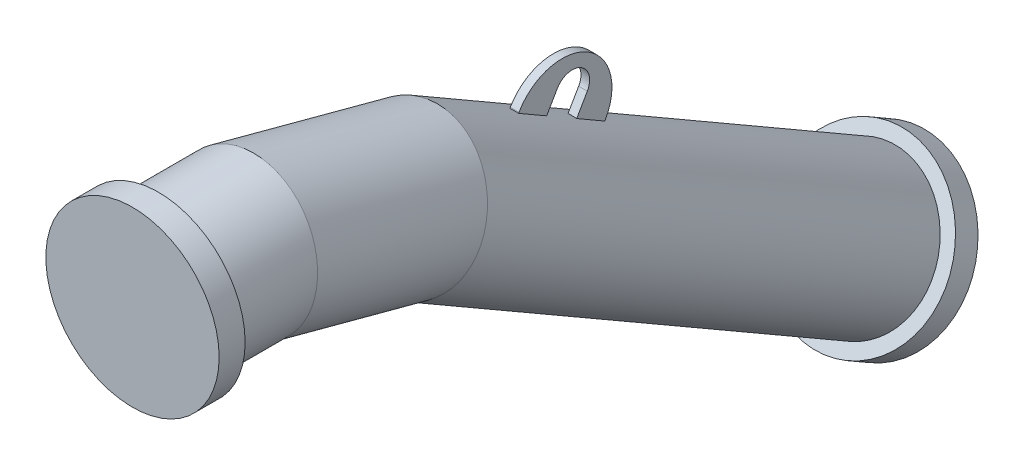
ISO-10303-21;
HEADER;
FILE_DESCRIPTION(('STEP AP214'),'2;1');
FILE_NAME('part.step','',(''),(''),'','','');
FILE_SCHEMA(('AUTOMOTIVE_DESIGN { 1 0 10303 214 1 1 1 1 }'));
ENDSEC;
DATA;
#1=APPLICATION_CONTEXT('core data for automotive mechanical design processes');
#2=APPLICATION_PROTOCOL_DEFINITION('international standard','automotive_design',2000,#1);
#3=PRODUCT_CONTEXT('',#1,'mechanical');
#4=PRODUCT('Part','Part','',(#3));
#5=PRODUCT_RELATED_PRODUCT_CATEGORY('part','',(#4));
#6=PRODUCT_DEFINITION_FORMATION('','',#4);
#7=PRODUCT_DEFINITION_CONTEXT('part definition',#1,'design');
#8=PRODUCT_DEFINITION('design','',#6,#7);
#9=PRODUCT_DEFINITION_SHAPE('','',#8);
#10=(LENGTH_UNIT() NAMED_UNIT(*) SI_UNIT(.MILLI.,.METRE.));
#11=(NAMED_UNIT(*) PLANE_ANGLE_UNIT() SI_UNIT($,.RADIAN.));
#12=(NAMED_UNIT(*) SI_UNIT($,.STERADIAN.) SOLID_ANGLE_UNIT());
#13=UNCERTAINTY_MEASURE_WITH_UNIT(LENGTH_MEASURE(1.E-05),#10,'distance_accuracy_value','');
#14=(GEOMETRIC_REPRESENTATION_CONTEXT(3) GLOBAL_UNCERTAINTY_ASSIGNED_CONTEXT((#13)) GLOBAL_UNIT_ASSIGNED_CONTEXT((#10,
#11,#12)) REPRESENTATION_CONTEXT('',''));
#15=CARTESIAN_POINT('',(0.,0.,0.));
#16=DIRECTION('',(0.,0.,1.));
#17=DIRECTION('',(1.,0.,0.));
#18=AXIS2_PLACEMENT_3D('',#15,#16,#17);
#19=CARTESIAN_POINT('',(5.00000000000023,-31.5171908510573,-502.55127018922));
#20=DIRECTION('',(1.,0.,0.));
#21=DIRECTION('',(0.,0.866025403784436,-0.500000000000001));
#22=AXIS2_PLACEMENT_3D('',#19,#20,#21);
#23=PLANE('',#22);
#24=DIRECTION('',(0.,0.866025403784437,-0.500000000000002));
#25=VECTOR('',#24,1.);
#26=CARTESIAN_POINT('',(5.00000000000025,-31.7790418778358,-436.004809471614));
#27=LINE('',#26,#25);
#28=CARTESIAN_POINT('',(5.00000000000025,-23.9836662846492,-440.505471668775));
#29=VERTEX_POINT('',#28);
#30=CARTESIAN_POINT('',(5.00000000000025,-23.1187878399915,-441.004809471614));
#31=VERTEX_POINT('',#30);
#32=EDGE_CURVE('E333',#29,#31,#27,.T.);
#33=ORIENTED_EDGE('',*,*,#32,.F.);
#34=DIRECTION('',(0.,-0.5,-0.866025403784436));
#35=VECTOR('',#34,1.);
#36=CARTESIAN_POINT('',(5.00000000000012,-228.363979689376,-794.502558552612));
#37=LINE('',#36,#35);
#38=CARTESIAN_POINT('',(5.00000000000023,-42.7336662846496,-472.981424310692));
#39=VERTEX_POINT('',#38);
#40=EDGE_CURVE('E50',#29,#39,#37,.T.);
#41=ORIENTED_EDGE('',*,*,#40,.T.);
#42=DIRECTION('',(0.,0.866025403784435,-0.500000000000002));
#43=VECTOR('',#42,1.);
#44=CARTESIAN_POINT('',(5.00000000000024,-41.8687878399916,-473.480762113531));
#45=LINE('',#44,#43);
#46=CARTESIAN_POINT('',(5.00000000000025,-21.5171908510572,-485.23076211353));
#47=VERTEX_POINT('',#46);
#48=EDGE_CURVE('E340',#39,#47,#45,.T.);
#49=ORIENTED_EDGE('',*,*,#48,.T.);
#50=CARTESIAN_POINT('',(5.00000000000023,-31.5171908510573,-502.55127018922));
#51=DIRECTION('',(-1.,0.,0.));
#52=DIRECTION('',(0.,0.866025403784436,-0.500000000000001));
#53=AXIS2_PLACEMENT_3D('',#50,#51,#52);
#54=CIRCLE('',#53,20.);
#55=CARTESIAN_POINT('',(5.00000000000023,-41.5171908510572,-519.871778264908));
#56=VERTEX_POINT('',#55);
#57=EDGE_CURVE('E343',#47,#56,#54,.T.);
#58=ORIENTED_EDGE('',*,*,#57,.T.);
#59=DIRECTION('',(0.,-0.866025403784436,0.500000000000001));
#60=VECTOR('',#59,1.);
#61=CARTESIAN_POINT('',(5.00000000000024,-61.8687878399916,-508.121778264908));
#62=LINE('',#61,#60);
#63=CARTESIAN_POINT('',(5.00000000000022,-62.7336662846495,-507.62244046207));
#64=VERTEX_POINT('',#63);
#65=EDGE_CURVE('E347',#56,#64,#62,.T.);
#66=ORIENTED_EDGE('',*,*,#65,.T.);
#67=CARTESIAN_POINT('',(5.00000000000024,-81.4836662846494,-540.098393103985));
#68=VERTEX_POINT('',#67);
#69=EDGE_CURVE('E312',#64,#68,#37,.T.);
#70=ORIENTED_EDGE('',*,*,#69,.T.);
#71=DIRECTION('',(0.,0.866025403784437,-0.500000000000002));
#72=VECTOR('',#71,1.);
#73=CARTESIAN_POINT('',(5.00000000000024,-89.2790418778362,-535.597730906825));
#74=LINE('',#73,#72);
#75=CARTESIAN_POINT('',(5.00000000000024,-80.6187878399918,-540.597730906825));
#76=VERTEX_POINT('',#75);
#77=EDGE_CURVE('E327',#68,#76,#74,.T.);
#78=ORIENTED_EDGE('',*,*,#77,.T.);
#79=CARTESIAN_POINT('',(5.00000000000025,-51.8687878399915,-490.801270189219));
#80=DIRECTION('',(1.,0.,0.));
#81=DIRECTION('',(0.,0.866025403784436,-0.500000000000001));
#82=AXIS2_PLACEMENT_3D('',#79,#80,#81);
#83=CIRCLE('',#82,57.5);
#84=EDGE_CURVE('E350',#76,#31,#83,.T.);
#85=ORIENTED_EDGE('',*,*,#84,.T.);
#86=EDGE_LOOP('',(#33,#41,#49,#58,#66,#70,#78,#85));
#87=FACE_BOUND('',#86,.T.);
#88=ADVANCED_FACE('F16',(#87),#23,.T.);
#89=CARTESIAN_POINT('',(-4.9999999999998,-31.5171908510572,-502.551270189219));
#90=DIRECTION('',(1.,0.,0.));
#91=DIRECTION('',(0.,0.866025403784436,-0.500000000000001));
#92=AXIS2_PLACEMENT_3D('',#89,#90,#91);
#93=PLANE('',#92);
#94=DIRECTION('',(0.,-0.5,-0.866025403784436));
#95=VECTOR('',#94,1.);
#96=CARTESIAN_POINT('',(-5.00000000000001,-228.363979689376,-794.502558552612));
#97=LINE('',#96,#95);
#98=CARTESIAN_POINT('',(-4.99999999999979,-23.9836662846491,-440.505471668775));
#99=VERTEX_POINT('',#98);
#100=CARTESIAN_POINT('',(-4.99999999999985,-42.7336662846495,-472.981424310692));
#101=VERTEX_POINT('',#100);
#102=EDGE_CURVE('E313',#99,#101,#97,.T.);
#103=ORIENTED_EDGE('',*,*,#102,.F.);
#104=DIRECTION('',(0.,0.866025403784437,-0.500000000000002));
#105=VECTOR('',#104,1.);
#106=CARTESIAN_POINT('',(-4.99999999999979,-31.7790418778358,-436.004809471614));
#107=LINE('',#106,#105);
#108=CARTESIAN_POINT('',(-4.99999999999979,-23.1187878399915,-441.004809471614));
#109=VERTEX_POINT('',#108);
#110=EDGE_CURVE('E336',#99,#109,#107,.T.);
#111=ORIENTED_EDGE('',*,*,#110,.T.);
#112=CARTESIAN_POINT('',(-4.99999999999979,-51.8687878399915,-490.801270189219));
#113=DIRECTION('',(1.,0.,0.));
#114=DIRECTION('',(0.,0.866025403784436,-0.500000000000001));
#115=AXIS2_PLACEMENT_3D('',#112,#113,#114);
#116=CIRCLE('',#115,57.5);
#117=CARTESIAN_POINT('',(-4.9999999999998,-80.6187878399918,-540.597730906825));
#118=VERTEX_POINT('',#117);
#119=EDGE_CURVE('E344',#118,#109,#116,.T.);
#120=ORIENTED_EDGE('',*,*,#119,.F.);
#121=DIRECTION('',(0.,0.866025403784437,-0.500000000000002));
#122=VECTOR('',#121,1.);
#123=CARTESIAN_POINT('',(-4.9999999999998,-89.2790418778362,-535.597730906825));
#124=LINE('',#123,#122);
#125=CARTESIAN_POINT('',(-4.9999999999998,-81.4836662846493,-540.098393103985));
#126=VERTEX_POINT('',#125);
#127=EDGE_CURVE('E330',#126,#118,#124,.T.);
#128=ORIENTED_EDGE('',*,*,#127,.F.);
#129=CARTESIAN_POINT('',(-4.99999999999986,-62.7336662846495,-507.62244046207));
#130=VERTEX_POINT('',#129);
#131=EDGE_CURVE('E281',#130,#126,#97,.T.);
#132=ORIENTED_EDGE('',*,*,#131,.F.);
#133=DIRECTION('',(0.,-0.866025403784436,0.500000000000001));
#134=VECTOR('',#133,1.);
#135=CARTESIAN_POINT('',(-4.9999999999998,-61.8687878399916,-508.121778264908));
#136=LINE('',#135,#134);
#137=CARTESIAN_POINT('',(-4.99999999999981,-41.5171908510572,-519.871778264908));
#138=VERTEX_POINT('',#137);
#139=EDGE_CURVE('E360',#138,#130,#136,.T.);
#140=ORIENTED_EDGE('',*,*,#139,.F.);
#141=CARTESIAN_POINT('',(-4.9999999999998,-31.5171908510572,-502.551270189219));
#142=DIRECTION('',(-1.,0.,0.));
#143=DIRECTION('',(0.,0.866025403784436,-0.500000000000001));
#144=AXIS2_PLACEMENT_3D('',#141,#142,#143);
#145=CIRCLE('',#144,20.);
#146=CARTESIAN_POINT('',(-4.99999999999979,-21.5171908510573,-485.230762113531));
#147=VERTEX_POINT('',#146);
#148=EDGE_CURVE('E357',#147,#138,#145,.T.);
#149=ORIENTED_EDGE('',*,*,#148,.F.);
#150=DIRECTION('',(0.,0.866025403784435,-0.500000000000002));
#151=VECTOR('',#150,1.);
#152=CARTESIAN_POINT('',(-4.99999999999979,-41.8687878399916,-473.48076211353));
#153=LINE('',#152,#151);
#154=EDGE_CURVE('E339',#101,#147,#153,.T.);
#155=ORIENTED_EDGE('',*,*,#154,.F.);
#156=EDGE_LOOP('',(#103,#111,#120,#128,#132,#140,#149,#155));
#157=FACE_BOUND('',#156,.T.);
#158=ADVANCED_FACE('F391',(#157),#93,.F.);
#159=CARTESIAN_POINT('',(5.00000000000024,-41.8687878399916,-473.480762113531));
#160=DIRECTION('',(0.,0.500000000000001,0.86602540378444));
#161=DIRECTION('',(0.,-0.866025403784435,0.500000000000002));
#162=AXIS2_PLACEMENT_3D('',#159,#160,#161);
#163=PLANE('',#162);
#164=CARTESIAN_POINT('',(1.92214923173637E-13,-115.480947161669,-430.980762113531));
#165=DIRECTION('',(0.,0.500000000000001,0.86602540378444));
#166=DIRECTION('',(0.,-0.866025403784439,0.5));
#167=AXIS2_PLACEMENT_3D('',#164,#165,#166);
#168=CIRCLE('',#167,84.15);
#169=EDGE_CURVE('E323',#101,#39,#168,.F.);
#170=ORIENTED_EDGE('',*,*,#169,.F.);
#171=ORIENTED_EDGE('',*,*,#154,.T.);
#172=DIRECTION('',(-1.,0.,0.));
#173=VECTOR('',#172,1.);
#174=CARTESIAN_POINT('',(5.00000000000025,-21.5171908510572,-485.23076211353));
#175=LINE('',#174,#173);
#176=EDGE_CURVE('E26',#47,#147,#175,.T.);
#177=ORIENTED_EDGE('',*,*,#176,.F.);
#178=ORIENTED_EDGE('',*,*,#48,.F.);
#179=EDGE_LOOP('',(#170,#171,#177,#178));
#180=FACE_BOUND('',#179,.T.);
#181=ADVANCED_FACE('F18',(#180),#163,.F.);
#182=CARTESIAN_POINT('',(5.00000000000023,-31.5171908510573,-502.55127018922));
#183=DIRECTION('',(-1.,0.,0.));
#184=DIRECTION('',(0.,-0.866025403784436,0.500000000000001));
#185=AXIS2_PLACEMENT_3D('',#182,#183,#184);
#186=CYLINDRICAL_SURFACE('',#185,20.);
#187=ORIENTED_EDGE('',*,*,#148,.T.);
#188=DIRECTION('',(-1.,0.,0.));
#189=VECTOR('',#188,1.);
#190=CARTESIAN_POINT('',(5.00000000000023,-41.5171908510572,-519.871778264908));
#191=LINE('',#190,#189);
#192=EDGE_CURVE('E373',#56,#138,#191,.T.);
#193=ORIENTED_EDGE('',*,*,#192,.F.);
#194=ORIENTED_EDGE('',*,*,#57,.F.);
#195=ORIENTED_EDGE('',*,*,#176,.T.);
#196=EDGE_LOOP('',(#187,#193,#194,#195));
#197=FACE_BOUND('',#196,.T.);
#198=ADVANCED_FACE('F384',(#197),#186,.F.);
#199=CARTESIAN_POINT('',(5.00000000000024,-61.8687878399916,-508.121778264908));
#200=DIRECTION('',(0.,-0.500000000000001,-0.86602540378444));
#201=DIRECTION('',(0.,0.866025403784436,-0.500000000000001));
#202=AXIS2_PLACEMENT_3D('',#199,#200,#201);
#203=PLANE('',#202);
#204=CARTESIAN_POINT('',(1.81959681644568E-13,-135.480947161669,-465.621778264908));
#205=DIRECTION('',(0.,-0.500000000000001,-0.86602540378444));
#206=DIRECTION('',(0.,0.866025403784439,-0.5));
#207=AXIS2_PLACEMENT_3D('',#204,#205,#206);
#208=CIRCLE('',#207,84.15);
#209=EDGE_CURVE('E38',#64,#130,#208,.F.);
#210=ORIENTED_EDGE('',*,*,#209,.F.);
#211=ORIENTED_EDGE('',*,*,#65,.F.);
#212=ORIENTED_EDGE('',*,*,#192,.T.);
#213=ORIENTED_EDGE('',*,*,#139,.T.);
#214=EDGE_LOOP('',(#210,#211,#212,#213));
#215=FACE_BOUND('',#214,.T.);
#216=ADVANCED_FACE('F394',(#215),#203,.F.);
#217=CARTESIAN_POINT('',(5.00000000000025,-51.8687878399915,-490.801270189219));
#218=DIRECTION('',(-1.,0.,0.));
#219=DIRECTION('',(0.,-0.866025403784436,0.500000000000001));
#220=AXIS2_PLACEMENT_3D('',#217,#218,#219);
#221=CYLINDRICAL_SURFACE('',#220,57.5);
#222=ORIENTED_EDGE('',*,*,#119,.T.);
#223=DIRECTION('',(-1.,0.,0.));
#224=VECTOR('',#223,1.);
#225=CARTESIAN_POINT('',(5.00000000000025,-23.1187878399915,-441.004809471614));
#226=LINE('',#225,#224);
#227=EDGE_CURVE('E354',#31,#109,#226,.T.);
#228=ORIENTED_EDGE('',*,*,#227,.F.);
#229=ORIENTED_EDGE('',*,*,#84,.F.);
#230=DIRECTION('',(-1.,0.,0.));
#231=VECTOR('',#230,1.);
#232=CARTESIAN_POINT('',(5.00000000000024,-80.6187878399918,-540.597730906825));
#233=LINE('',#232,#231);
#234=EDGE_CURVE('E369',#76,#118,#233,.T.);
#235=ORIENTED_EDGE('',*,*,#234,.T.);
#236=EDGE_LOOP('',(#222,#228,#229,#235));
#237=FACE_BOUND('',#236,.T.);
#238=ADVANCED_FACE('F482',(#237),#221,.T.);
#239=CARTESIAN_POINT('',(5.00000000000025,-31.7790418778358,-436.004809471614));
#240=DIRECTION('',(0.,-0.500000000000002,-0.866025403784437));
#241=DIRECTION('',(0.,0.866025403784437,-0.500000000000002));
#242=AXIS2_PLACEMENT_3D('',#239,#240,#241);
#243=PLANE('',#242);
#244=CARTESIAN_POINT('',(2.01829212107139E-13,-96.7309471616688,-398.504809471614));
#245=DIRECTION('',(0.,-0.500000000000002,-0.866025403784437));
#246=DIRECTION('',(0.,0.866025403784437,-0.500000000000002));
#247=AXIS2_PLACEMENT_3D('',#244,#245,#246);
#248=CIRCLE('',#247,84.15);
#249=EDGE_CURVE('E319',#29,#99,#248,.F.);
#250=ORIENTED_EDGE('',*,*,#249,.F.);
#251=ORIENTED_EDGE('',*,*,#32,.T.);
#252=ORIENTED_EDGE('',*,*,#227,.T.);
#253=ORIENTED_EDGE('',*,*,#110,.F.);
#254=EDGE_LOOP('',(#250,#251,#252,#253));
#255=FACE_BOUND('',#254,.T.);
#256=ADVANCED_FACE('F498',(#255),#243,.F.);
#257=CARTESIAN_POINT('',(-4.9999999999998,-89.2790418778362,-535.597730906825));
#258=DIRECTION('',(0.,0.500000000000002,0.866025403784437));
#259=DIRECTION('',(0.,-0.866025403784437,0.500000000000002));
#260=AXIS2_PLACEMENT_3D('',#257,#258,#259);
#261=PLANE('',#260);
#262=CARTESIAN_POINT('',(1.72345392711067E-13,-154.230947161669,-498.097730906824));
#263=DIRECTION('',(0.,0.500000000000002,0.866025403784437));
#264=DIRECTION('',(0.,-0.866025403784437,0.500000000000002));
#265=AXIS2_PLACEMENT_3D('',#262,#263,#264);
#266=CIRCLE('',#265,84.15);
#267=EDGE_CURVE('E10',#126,#68,#266,.F.);
#268=ORIENTED_EDGE('',*,*,#267,.F.);
#269=ORIENTED_EDGE('',*,*,#127,.T.);
#270=ORIENTED_EDGE('',*,*,#234,.F.);
#271=ORIENTED_EDGE('',*,*,#77,.F.);
#272=EDGE_LOOP('',(#268,#269,#270,#271));
#273=FACE_BOUND('',#272,.T.);
#274=ADVANCED_FACE('F506',(#273),#261,.F.);
#275=CARTESIAN_POINT('',(0.,-301.111260566396,-752.501896355451));
#276=DIRECTION('',(0.,-0.5,-0.866025403784436));
#277=DIRECTION('',(-1.,0.,0.));
#278=AXIS2_PLACEMENT_3D('',#275,#276,#277);
#279=CYLINDRICAL_SURFACE('',#278,84.15);
#280=CARTESIAN_POINT('',(0.,-350.480947161669,-838.012701892216));
#281=DIRECTION('',(0.,0.5,0.866025403784436));
#282=DIRECTION('',(1.,0.,0.));
#283=AXIS2_PLACEMENT_3D('',#280,#281,#282);
#284=CIRCLE('',#283,84.15);
#285=CARTESIAN_POINT('',(84.1500000000001,-350.480947161669,-838.012701892216));
#286=VERTEX_POINT('',#285);
#287=EDGE_CURVE('E277',#286,#286,#284,.T.);
#288=ORIENTED_EDGE('',*,*,#287,.T.);
#289=EDGE_LOOP('',(#288));
#290=FACE_BOUND('',#289,.T.);
#291=CARTESIAN_POINT('',(0.,-51.1112605663978,-319.489194463235));
#292=DIRECTION('',(0.,-0.382683432365091,-0.923879532511286));
#293=DIRECTION('',(0.,-0.923879532511286,0.382683432365091));
#294=AXIS2_PLACEMENT_3D('',#291,#292,#293);
#295=ELLIPSE('',#294,84.8761270328199,84.15);
#296=CARTESIAN_POINT('',(0.,-129.526577130848,-287.00850684446));
#297=VERTEX_POINT('',#296);
#298=EDGE_CURVE('E276',#297,#297,#295,.T.);
#299=ORIENTED_EDGE('',*,*,#298,.T.);
#300=EDGE_LOOP('',(#299));
#301=FACE_BOUND('',#300,.T.);
#302=ORIENTED_EDGE('',*,*,#69,.F.);
#303=ORIENTED_EDGE('',*,*,#209,.T.);
#304=ORIENTED_EDGE('',*,*,#131,.T.);
#305=ORIENTED_EDGE('',*,*,#267,.T.);
#306=EDGE_LOOP('',(#302,#303,#304,#305));
#307=FACE_BOUND('',#306,.T.);
#308=ORIENTED_EDGE('',*,*,#102,.T.);
#309=ORIENTED_EDGE('',*,*,#169,.T.);
#310=ORIENTED_EDGE('',*,*,#40,.F.);
#311=ORIENTED_EDGE('',*,*,#249,.T.);
#312=EDGE_LOOP('',(#308,#309,#310,#311));
#313=FACE_BOUND('',#312,.T.);
#314=ADVANCED_FACE('F397',(#290,#301,#307,#313),#279,.T.);
#315=CARTESIAN_POINT('',(-1.65594231806833E-13,-350.480947161669,-838.012701892217));
#316=DIRECTION('',(0.,-0.500000000000001,-0.86602540378444));
#317=DIRECTION('',(1.,0.,0.));
#318=AXIS2_PLACEMENT_3D('',#315,#316,#317);
#319=CYLINDRICAL_SURFACE('',#318,100.);
#320=CARTESIAN_POINT('',(-1.65594231806833E-13,-350.480947161669,-838.012701892217));
#321=DIRECTION('',(0.,-0.500000000000001,-0.86602540378444));
#322=DIRECTION('',(1.,0.,0.));
#323=AXIS2_PLACEMENT_3D('',#320,#321,#322);
#324=CIRCLE('',#323,100.);
#325=CARTESIAN_POINT('',(99.9999999999998,-350.480947161669,-838.012701892217));
#326=VERTEX_POINT('',#325);
#327=EDGE_CURVE('E282',#326,#326,#324,.T.);
#328=ORIENTED_EDGE('',*,*,#327,.T.);
#329=EDGE_LOOP('',(#328));
#330=FACE_BOUND('',#329,.T.);
#331=CARTESIAN_POINT('',(-1.73472347597681E-13,-365.480947161669,-863.99346400575));
#332=DIRECTION('',(0.,-0.500000000000001,-0.86602540378444));
#333=DIRECTION('',(1.,0.,0.));
#334=AXIS2_PLACEMENT_3D('',#331,#332,#333);
#335=CIRCLE('',#334,100.);
#336=CARTESIAN_POINT('',(99.9999999999998,-365.480947161669,-863.99346400575));
#337=VERTEX_POINT('',#336);
#338=EDGE_CURVE('E291',#337,#337,#335,.T.);
#339=ORIENTED_EDGE('',*,*,#338,.F.);
#340=EDGE_LOOP('',(#339));
#341=FACE_BOUND('',#340,.T.);
#342=ADVANCED_FACE('F522',(#330,#341),#319,.T.);
#343=CARTESIAN_POINT('',(-1.65594231806833E-13,-350.480947161669,-838.012701892217));
#344=DIRECTION('',(0.,-0.500000000000001,-0.86602540378444));
#345=DIRECTION('',(1.,0.,0.));
#346=AXIS2_PLACEMENT_3D('',#343,#344,#345);
#347=PLANE('',#346);
#348=ORIENTED_EDGE('',*,*,#287,.F.);
#349=EDGE_LOOP('',(#348));
#350=FACE_BOUND('',#349,.T.);
#351=ORIENTED_EDGE('',*,*,#327,.F.);
#352=EDGE_LOOP('',(#351));
#353=FACE_BOUND('',#352,.T.);
#354=ADVANCED_FACE('F531',(#350,#353),#347,.F.);
#355=CARTESIAN_POINT('',(0.,0.,-30.));
#356=DIRECTION('',(0.,0.,1.));
#357=DIRECTION('',(1.,0.,0.));
#358=AXIS2_PLACEMENT_3D('',#355,#356,#357);
#359=CYLINDRICAL_SURFACE('',#358,100.);
#360=CARTESIAN_POINT('',(0.,0.,-30.));
#361=DIRECTION('',(0.,0.,1.));
#362=DIRECTION('',(1.,0.,0.));
#363=AXIS2_PLACEMENT_3D('',#360,#361,#362);
#364=CIRCLE('',#363,100.);
#365=CARTESIAN_POINT('',(100.,0.,-30.));
#366=VERTEX_POINT('',#365);
#367=EDGE_CURVE('E292',#366,#366,#364,.T.);
#368=ORIENTED_EDGE('',*,*,#367,.T.);
#369=EDGE_LOOP('',(#368));
#370=FACE_BOUND('',#369,.T.);
#371=CARTESIAN_POINT('',(0.,0.,0.));
#372=DIRECTION('',(0.,0.,1.));
#373=DIRECTION('',(1.,0.,0.));
#374=AXIS2_PLACEMENT_3D('',#371,#372,#373);
#375=CIRCLE('',#374,100.);
#376=CARTESIAN_POINT('',(100.,0.,0.));
#377=VERTEX_POINT('',#376);
#378=EDGE_CURVE('E296',#377,#377,#375,.T.);
#379=ORIENTED_EDGE('',*,*,#378,.F.);
#380=EDGE_LOOP('',(#379));
#381=FACE_BOUND('',#380,.T.);
#382=ADVANCED_FACE('F540',(#370,#381),#359,.T.);
#383=CARTESIAN_POINT('',(0.,0.,-30.));
#384=DIRECTION('',(0.,0.,1.));
#385=DIRECTION('',(1.,0.,0.));
#386=AXIS2_PLACEMENT_3D('',#383,#384,#385);
#387=PLANE('',#386);
#388=CARTESIAN_POINT('',(0.,0.,-30.));
#389=DIRECTION('',(0.,0.,-1.));
#390=DIRECTION('',(-1.,0.,0.));
#391=AXIS2_PLACEMENT_3D('',#388,#389,#390);
#392=CIRCLE('',#391,84.15);
#393=CARTESIAN_POINT('',(-84.15,0.,-30.));
#394=VERTEX_POINT('',#393);
#395=EDGE_CURVE('E287',#394,#394,#392,.T.);
#396=ORIENTED_EDGE('',*,*,#395,.F.);
#397=EDGE_LOOP('',(#396));
#398=FACE_BOUND('',#397,.T.);
#399=ORIENTED_EDGE('',*,*,#367,.F.);
#400=EDGE_LOOP('',(#399));
#401=FACE_BOUND('',#400,.T.);
#402=ADVANCED_FACE('F469',(#398,#401),#387,.F.);
#403=CARTESIAN_POINT('',(0.,0.,-128.739373190547));
#404=DIRECTION('',(0.,0.,1.));
#405=DIRECTION('',(1.,0.,0.));
#406=AXIS2_PLACEMENT_3D('',#403,#404,#405);
#407=CYLINDRICAL_SURFACE('',#406,84.15);
#408=ORIENTED_EDGE('',*,*,#395,.T.);
#409=EDGE_LOOP('',(#408));
#410=FACE_BOUND('',#409,.T.);
#411=CARTESIAN_POINT('',(0.,0.,-128.739373190547));
#412=DIRECTION('',(0.,-0.130526192220051,-0.99144486137381));
#413=DIRECTION('',(0.,-0.991444861373811,0.130526192220052));
#414=AXIS2_PLACEMENT_3D('',#411,#412,#413);
#415=ELLIPSE('',#414,84.8761270328199,84.15);
#416=CARTESIAN_POINT('',(0.,-84.15,-117.660815518567));
#417=VERTEX_POINT('',#416);
#418=EDGE_CURVE('E286',#417,#417,#415,.T.);
#419=ORIENTED_EDGE('',*,*,#418,.F.);
#420=EDGE_LOOP('',(#419));
#421=FACE_BOUND('',#420,.T.);
#422=ADVANCED_FACE('F463',(#410,#421),#407,.T.);
#423=CARTESIAN_POINT('',(0.,-51.1112605663978,-319.489194463235));
#424=DIRECTION('',(0.,0.258819045102521,0.965925826289068));
#425=DIRECTION('',(0.,-0.965925826289068,0.258819045102521));
#426=AXIS2_PLACEMENT_3D('',#423,#424,#425);
#427=CYLINDRICAL_SURFACE('',#426,84.15);
#428=ORIENTED_EDGE('',*,*,#298,.F.);
#429=EDGE_LOOP('',(#428));
#430=FACE_BOUND('',#429,.T.);
#431=ORIENTED_EDGE('',*,*,#418,.T.);
#432=EDGE_LOOP('',(#431));
#433=FACE_BOUND('',#432,.T.);
#434=ADVANCED_FACE('F468',(#430,#433),#427,.T.);
#435=CARTESIAN_POINT('',(0.,0.,0.));
#436=DIRECTION('',(0.,0.,1.));
#437=DIRECTION('',(1.,0.,0.));
#438=AXIS2_PLACEMENT_3D('',#435,#436,#437);
#439=PLANE('',#438);
#440=ORIENTED_EDGE('',*,*,#378,.T.);
#441=EDGE_LOOP('',(#440));
#442=FACE_BOUND('',#441,.T.);
#443=ADVANCED_FACE('F1168',(#442),#439,.T.);
#444=CARTESIAN_POINT('',(-1.73472347597681E-13,-365.480947161669,-863.99346400575));
#445=DIRECTION('',(0.,-0.500000000000001,-0.86602540378444));
#446=DIRECTION('',(1.,0.,0.));
#447=AXIS2_PLACEMENT_3D('',#444,#445,#446);
#448=PLANE('',#447);
#449=ORIENTED_EDGE('',*,*,#338,.T.);
#450=EDGE_LOOP('',(#449));
#451=FACE_BOUND('',#450,.T.);
#452=ADVANCED_FACE('F1161',(#451),#448,.T.);
#453=CLOSED_SHELL('',(#88,#158,#181,#198,#216,#238,#256,#274,#314,#342,#354,#382,#402,#422,#434,
#443,#452));
#454=CARTESIAN_POINT('',(-1.66907251105308E-13,-352.980947161669,-842.342828911139));
#455=DIRECTION('',(0.,-0.5,-0.866025403784439));
#456=DIRECTION('',(0.,0.866025403784438,-0.5));
#457=AXIS2_PLACEMENT_3D('',#454,#455,#456);
#458=PLANE('',#457);
#459=CARTESIAN_POINT('',(-1.66907251105308E-13,-352.980947161669,-842.342828911139));
#460=DIRECTION('',(0.,-0.5,-0.866025403784439));
#461=DIRECTION('',(0.,0.866025403784438,-0.5));
#462=AXIS2_PLACEMENT_3D('',#459,#460,#461);
#463=CIRCLE('',#462,39.5);
#464=CARTESIAN_POINT('',(-1.66907251105308E-13,-318.772943712183,-862.092828911139));
#465=VERTEX_POINT('',#464);
#466=EDGE_CURVE('E272',#465,#465,#463,.F.);
#467=ORIENTED_EDGE('',*,*,#466,.T.);
#468=EDGE_LOOP('',(#467));
#469=FACE_BOUND('',#468,.T.);
#470=ADVANCED_FACE('F1145',(#469),#458,.F.);
#471=CARTESIAN_POINT('',(0.,0.,-30.));
#472=DIRECTION('',(0.,0.,1.));
#473=DIRECTION('',(1.,0.,0.));
#474=AXIS2_PLACEMENT_3D('',#471,#472,#473);
#475=PLANE('',#474);
#476=CARTESIAN_POINT('',(0.,0.,-30.));
#477=DIRECTION('',(0.,0.,1.));
#478=DIRECTION('',(1.,0.,0.));
#479=AXIS2_PLACEMENT_3D('',#476,#477,#478);
#480=CIRCLE('',#479,39.5);
#481=CARTESIAN_POINT('',(39.5,0.,-30.));
#482=VERTEX_POINT('',#481);
#483=EDGE_CURVE('E202',#482,#482,#480,.T.);
#484=ORIENTED_EDGE('',*,*,#483,.T.);
#485=EDGE_LOOP('',(#484));
#486=FACE_BOUND('',#485,.T.);
#487=CARTESIAN_POINT('',(0.,0.,-30.));
#488=DIRECTION('',(0.,0.,-1.));
#489=DIRECTION('',(0.,1.,0.));
#490=AXIS2_PLACEMENT_3D('',#487,#488,#489);
#491=CIRCLE('',#490,40.);
#492=CARTESIAN_POINT('',(0.,40.,-30.));
#493=VERTEX_POINT('',#492);
#494=EDGE_CURVE('E257',#493,#493,#491,.T.);
#495=ORIENTED_EDGE('',*,*,#494,.T.);
#496=EDGE_LOOP('',(#495));
#497=FACE_BOUND('',#496,.T.);
#498=ADVANCED_FACE('F1133',(#486,#497),#475,.F.);
#499=CARTESIAN_POINT('',(0.,-750.,-30.));
#500=DIRECTION('',(-1.,0.,0.));
#501=DIRECTION('',(0.,0.,1.));
#502=AXIS2_PLACEMENT_3D('',#499,#500,#501);
#503=TOROIDAL_SURFACE('',#502,750.,40.);
#504=CARTESIAN_POINT('',(1.33160392341586E-13,-100.480947161669,-404.999999999997));
#505=DIRECTION('',(0.,0.500000000000001,0.866025403784438));
#506=DIRECTION('',(1.,0.,0.));
#507=AXIS2_PLACEMENT_3D('',#504,#505,#506);
#508=CIRCLE('',#507,40.);
#509=CARTESIAN_POINT('',(1.40262279933137E-13,-65.8399310102915,-424.999999999997));
#510=VERTEX_POINT('',#509);
#511=EDGE_CURVE('E256',#510,#510,#508,.T.);
#512=CARTESIAN_POINT('',(0.,-750.,-30.));
#513=DIRECTION('',(-1.,0.,0.));
#514=DIRECTION('',(0.,0.,1.));
#515=AXIS2_PLACEMENT_3D('',#512,#513,#514);
#516=CIRCLE('',#515,790.);
#517=EDGE_CURVE('',#493,#510,#516,.T.);
#518=ORIENTED_EDGE('',*,*,#494,.F.);
#519=ORIENTED_EDGE('',*,*,#511,.F.);
#520=ORIENTED_EDGE('',*,*,#517,.T.);
#521=ORIENTED_EDGE('',*,*,#517,.F.);
#522=EDGE_LOOP('',(#518,#520,#519,#521));
#523=FACE_BOUND('',#522,.T.);
#524=ADVANCED_FACE('F1123',(#523),#503,.F.);
#525=CARTESIAN_POINT('',(1.33160392341586E-13,-100.480947161669,-404.999999999997));
#526=DIRECTION('',(0.,-0.500000000000001,-0.866025403784438));
#527=DIRECTION('',(-1.,0.,0.));
#528=AXIS2_PLACEMENT_3D('',#525,#526,#527);
#529=CYLINDRICAL_SURFACE('',#528,40.);
#530=ORIENTED_EDGE('',*,*,#511,.T.);
#531=EDGE_LOOP('',(#530));
#532=FACE_BOUND('',#531,.T.);
#533=CARTESIAN_POINT('',(0.,-350.48094716167,-838.012701892216));
#534=DIRECTION('',(0.,0.500000000000001,0.866025403784438));
#535=DIRECTION('',(1.,0.,0.));
#536=AXIS2_PLACEMENT_3D('',#533,#534,#535);
#537=CIRCLE('',#536,40.);
#538=CARTESIAN_POINT('',(40.,-350.48094716167,-838.012701892216));
#539=VERTEX_POINT('',#538);
#540=EDGE_CURVE('E261',#539,#539,#537,.T.);
#541=ORIENTED_EDGE('',*,*,#540,.F.);
#542=EDGE_LOOP('',(#541));
#543=FACE_BOUND('',#542,.T.);
#544=ADVANCED_FACE('F1111',(#532,#543),#529,.F.);
#545=CARTESIAN_POINT('',(-1.65594231806833E-13,-350.480947161669,-838.012701892217));
#546=DIRECTION('',(0.,-0.500000000000001,-0.86602540378444));
#547=DIRECTION('',(1.,0.,0.));
#548=AXIS2_PLACEMENT_3D('',#545,#546,#547);
#549=PLANE('',#548);
#550=CARTESIAN_POINT('',(-1.65594231806833E-13,-350.480947161669,-838.012701892217));
#551=DIRECTION('',(0.,-0.500000000000001,-0.86602540378444));
#552=DIRECTION('',(1.,0.,0.));
#553=AXIS2_PLACEMENT_3D('',#550,#551,#552);
#554=CIRCLE('',#553,39.5);
#555=CARTESIAN_POINT('',(39.4999999999998,-350.480947161669,-838.012701892217));
#556=VERTEX_POINT('',#555);
#557=EDGE_CURVE('E268',#556,#556,#554,.T.);
#558=ORIENTED_EDGE('',*,*,#557,.T.);
#559=EDGE_LOOP('',(#558));
#560=FACE_BOUND('',#559,.T.);
#561=ORIENTED_EDGE('',*,*,#540,.T.);
#562=EDGE_LOOP('',(#561));
#563=FACE_BOUND('',#562,.T.);
#564=ADVANCED_FACE('F1098',(#560,#563),#549,.F.);
#565=CARTESIAN_POINT('',(-1.65594231806833E-13,-350.480947161669,-838.012701892217));
#566=DIRECTION('',(0.,-0.500000000000001,-0.86602540378444));
#567=DIRECTION('',(1.,0.,0.));
#568=AXIS2_PLACEMENT_3D('',#565,#566,#567);
#569=CYLINDRICAL_SURFACE('',#568,39.5);
#570=ORIENTED_EDGE('',*,*,#557,.F.);
#571=EDGE_LOOP('',(#570));
#572=FACE_BOUND('',#571,.T.);
#573=ORIENTED_EDGE('',*,*,#466,.F.);
#574=EDGE_LOOP('',(#573));
#575=FACE_BOUND('',#574,.T.);
#576=ADVANCED_FACE('F1083',(#572,#575),#569,.F.);
#577=CARTESIAN_POINT('',(0.,0.,-25.));
#578=DIRECTION('',(0.,0.,1.));
#579=DIRECTION('',(1.,0.,0.));
#580=AXIS2_PLACEMENT_3D('',#577,#578,#579);
#581=PLANE('',#580);
#582=CARTESIAN_POINT('',(0.,0.,-25.));
#583=DIRECTION('',(0.,0.,1.));
#584=DIRECTION('',(1.,0.,0.));
#585=AXIS2_PLACEMENT_3D('',#582,#583,#584);
#586=CIRCLE('',#585,39.5);
#587=CARTESIAN_POINT('',(39.5,0.,-25.));
#588=VERTEX_POINT('',#587);
#589=EDGE_CURVE('E201',#588,#588,#586,.F.);
#590=ORIENTED_EDGE('',*,*,#589,.T.);
#591=EDGE_LOOP('',(#590));
#592=FACE_BOUND('',#591,.T.);
#593=ADVANCED_FACE('F452',(#592),#581,.F.);
#594=CARTESIAN_POINT('',(0.,0.,-30.));
#595=DIRECTION('',(0.,0.,1.));
#596=DIRECTION('',(1.,0.,0.));
#597=AXIS2_PLACEMENT_3D('',#594,#595,#596);
#598=CYLINDRICAL_SURFACE('',#597,39.5);
#599=ORIENTED_EDGE('',*,*,#483,.F.);
#600=EDGE_LOOP('',(#599));
#601=FACE_BOUND('',#600,.T.);
#602=ORIENTED_EDGE('',*,*,#589,.F.);
#603=EDGE_LOOP('',(#602));
#604=FACE_BOUND('',#603,.T.);
#605=ADVANCED_FACE('F447',(#601,#604),#598,.F.);
#606=CLOSED_SHELL('',(#470,#498,#524,#544,#564,#576,#593,#605));
#607=CARTESIAN_POINT('',(-73.9103626009029,-30.6146745892072,-23.9999999999997));
#608=DIRECTION('',(0.,0.,1.));
#609=DIRECTION('',(0.,-1.,0.));
#610=AXIS2_PLACEMENT_3D('',#607,#608,#609);
#611=PLANE('',#610);
#612=CARTESIAN_POINT('',(-73.9103626009029,-30.6146745892072,-23.9999999999997));
#613=DIRECTION('',(0.,0.,1.));
#614=DIRECTION('',(1.,0.,0.));
#615=AXIS2_PLACEMENT_3D('',#612,#613,#614);
#616=CIRCLE('',#615,7.);
#617=CARTESIAN_POINT('',(-66.910362600903,-30.6146745892072,-23.9999999999997));
#618=VERTEX_POINT('',#617);
#619=EDGE_CURVE('E213',#618,#618,#616,.T.);
#620=ORIENTED_EDGE('',*,*,#619,.F.);
#621=EDGE_LOOP('',(#620));
#622=FACE_BOUND('',#621,.T.);
#623=ADVANCED_FACE('F1059',(#622),#611,.F.);
#624=CARTESIAN_POINT('',(-73.9103626009029,-30.6146745892072,-23.9999999999997));
#625=DIRECTION('',(0.,0.,1.));
#626=DIRECTION('',(1.,0.,0.));
#627=AXIS2_PLACEMENT_3D('',#624,#625,#626);
#628=CONICAL_SURFACE('',#627,7.,1.02974425867665);
#629=CARTESIAN_POINT('',(-73.9103626009029,-30.6146745892072,-28.2060243331929));
#630=VERTEX_POINT('',#629);
#631=VERTEX_LOOP('',#630);
#632=FACE_BOUND('',#631,.T.);
#633=ORIENTED_EDGE('',*,*,#619,.T.);
#634=EDGE_LOOP('',(#633));
#635=FACE_BOUND('',#634,.T.);
#636=ADVANCED_FACE('F1054',(#632,#635),#628,.F.);
#637=CLOSED_SHELL('',(#623,#636));
#638=CARTESIAN_POINT('',(-73.9103626009035,-379.994033084516,-827.90151702032));
#639=DIRECTION('',(0.,-0.500000000000001,-0.86602540378444));
#640=DIRECTION('',(0.,0.866025403784438,-0.5));
#641=AXIS2_PLACEMENT_3D('',#638,#639,#640);
#642=PLANE('',#641);
#643=CARTESIAN_POINT('',(-73.9103626009035,-379.994033084516,-827.90151702032));
#644=DIRECTION('',(0.,-0.500000000000001,-0.86602540378444));
#645=DIRECTION('',(1.,0.,0.));
#646=AXIS2_PLACEMENT_3D('',#643,#644,#645);
#647=CIRCLE('',#646,6.99999999999999);
#648=CARTESIAN_POINT('',(-66.9103626009035,-379.994033084516,-827.90151702032));
#649=VERTEX_POINT('',#648);
#650=EDGE_CURVE('E230',#649,#649,#647,.T.);
#651=ORIENTED_EDGE('',*,*,#650,.F.);
#652=EDGE_LOOP('',(#651));
#653=FACE_BOUND('',#652,.T.);
#654=ADVANCED_FACE('F1035',(#653),#642,.F.);
#655=CARTESIAN_POINT('',(-73.9103626009035,-379.994033084516,-827.90151702032));
#656=DIRECTION('',(0.,-0.500000000000001,-0.86602540378444));
#657=DIRECTION('',(1.,0.,0.));
#658=AXIS2_PLACEMENT_3D('',#655,#656,#657);
#659=CONICAL_SURFACE('',#658,6.99999999999999,1.02974425867665);
#660=CARTESIAN_POINT('',(-73.9103626009035,-377.891020917919,-824.25899309884));
#661=VERTEX_POINT('',#660);
#662=VERTEX_LOOP('',#661);
#663=FACE_BOUND('',#662,.T.);
#664=ORIENTED_EDGE('',*,*,#650,.T.);
#665=EDGE_LOOP('',(#664));
#666=FACE_BOUND('',#665,.T.);
#667=ADVANCED_FACE('F1030',(#663,#666),#659,.F.);
#668=CLOSED_SHELL('',(#654,#667));
#669=CARTESIAN_POINT('',(-30.6146745892082,-417.48919877697,-806.253673014472));
#670=DIRECTION('',(0.,-0.500000000000001,-0.86602540378444));
#671=DIRECTION('',(0.,0.866025403784438,-0.5));
#672=AXIS2_PLACEMENT_3D('',#669,#670,#671);
#673=PLANE('',#672);
#674=CARTESIAN_POINT('',(-30.6146745892082,-417.48919877697,-806.253673014472));
#675=DIRECTION('',(0.,-0.500000000000001,-0.86602540378444));
#676=DIRECTION('',(1.,0.,0.));
#677=AXIS2_PLACEMENT_3D('',#674,#675,#676);
#678=CIRCLE('',#677,6.99999999999999);
#679=CARTESIAN_POINT('',(-23.6146745892082,-417.48919877697,-806.253673014472));
#680=VERTEX_POINT('',#679);
#681=EDGE_CURVE('E226',#680,#680,#678,.T.);
#682=ORIENTED_EDGE('',*,*,#681,.F.);
#683=EDGE_LOOP('',(#682));
#684=FACE_BOUND('',#683,.T.);
#685=ADVANCED_FACE('F1011',(#684),#673,.F.);
#686=CARTESIAN_POINT('',(-30.6146745892082,-417.48919877697,-806.253673014472));
#687=DIRECTION('',(0.,-0.500000000000001,-0.86602540378444));
#688=DIRECTION('',(1.,0.,0.));
#689=AXIS2_PLACEMENT_3D('',#686,#687,#688);
#690=CONICAL_SURFACE('',#689,6.99999999999999,1.02974425867665);
#691=CARTESIAN_POINT('',(-30.6146745892082,-415.386186610373,-802.611149092991));
#692=VERTEX_POINT('',#691);
#693=VERTEX_LOOP('',#692);
#694=FACE_BOUND('',#693,.T.);
#695=ORIENTED_EDGE('',*,*,#681,.T.);
#696=EDGE_LOOP('',(#695));
#697=FACE_BOUND('',#696,.T.);
#698=ADVANCED_FACE('F1006',(#694,#697),#690,.F.);
#699=CLOSED_SHELL('',(#685,#698));
#700=CARTESIAN_POINT('',(30.6146745892063,-417.48919877697,-806.253673014472));
#701=DIRECTION('',(0.,-0.500000000000001,-0.86602540378444));
#702=DIRECTION('',(0.,0.866025403784438,-0.5));
#703=AXIS2_PLACEMENT_3D('',#700,#701,#702);
#704=PLANE('',#703);
#705=CARTESIAN_POINT('',(30.6146745892063,-417.48919877697,-806.253673014472));
#706=DIRECTION('',(0.,-0.500000000000001,-0.86602540378444));
#707=DIRECTION('',(1.,0.,0.));
#708=AXIS2_PLACEMENT_3D('',#705,#706,#707);
#709=CIRCLE('',#708,6.99999999999999);
#710=CARTESIAN_POINT('',(37.6146745892063,-417.48919877697,-806.253673014472));
#711=VERTEX_POINT('',#710);
#712=EDGE_CURVE('E221',#711,#711,#709,.T.);
#713=ORIENTED_EDGE('',*,*,#712,.F.);
#714=EDGE_LOOP('',(#713));
#715=FACE_BOUND('',#714,.T.);
#716=ADVANCED_FACE('F987',(#715),#704,.F.);
#717=CARTESIAN_POINT('',(30.6146745892063,-417.48919877697,-806.253673014472));
#718=DIRECTION('',(0.,-0.500000000000001,-0.86602540378444));
#719=DIRECTION('',(1.,0.,0.));
#720=AXIS2_PLACEMENT_3D('',#717,#718,#719);
#721=CONICAL_SURFACE('',#720,6.99999999999999,1.02974425867665);
#722=CARTESIAN_POINT('',(30.6146745892063,-415.386186610374,-802.611149092991));
#723=VERTEX_POINT('',#722);
#724=VERTEX_LOOP('',#723);
#725=FACE_BOUND('',#724,.T.);
#726=ORIENTED_EDGE('',*,*,#712,.T.);
#727=EDGE_LOOP('',(#726));
#728=FACE_BOUND('',#727,.T.);
#729=ADVANCED_FACE('F982',(#725,#728),#721,.F.);
#730=CLOSED_SHELL('',(#716,#729));
#731=CARTESIAN_POINT('',(73.9103626009025,-379.994033084517,-827.90151702032));
#732=DIRECTION('',(0.,-0.500000000000001,-0.86602540378444));
#733=DIRECTION('',(0.,0.866025403784438,-0.5));
#734=AXIS2_PLACEMENT_3D('',#731,#732,#733);
#735=PLANE('',#734);
#736=CARTESIAN_POINT('',(73.9103626009025,-379.994033084517,-827.90151702032));
#737=DIRECTION('',(0.,-0.500000000000001,-0.86602540378444));
#738=DIRECTION('',(1.,0.,0.));
#739=AXIS2_PLACEMENT_3D('',#736,#737,#738);
#740=CIRCLE('',#739,7.);
#741=CARTESIAN_POINT('',(80.9103626009025,-379.994033084517,-827.90151702032));
#742=VERTEX_POINT('',#741);
#743=EDGE_CURVE('E225',#742,#742,#740,.T.);
#744=ORIENTED_EDGE('',*,*,#743,.F.);
#745=EDGE_LOOP('',(#744));
#746=FACE_BOUND('',#745,.T.);
#747=ADVANCED_FACE('F964',(#746),#735,.F.);
#748=CARTESIAN_POINT('',(73.9103626009025,-379.994033084517,-827.90151702032));
#749=DIRECTION('',(0.,-0.500000000000001,-0.86602540378444));
#750=DIRECTION('',(1.,0.,0.));
#751=AXIS2_PLACEMENT_3D('',#748,#749,#750);
#752=CONICAL_SURFACE('',#751,7.,1.02974425867665);
#753=CARTESIAN_POINT('',(73.9103626009025,-377.89102091792,-824.258993098839));
#754=VERTEX_POINT('',#753);
#755=VERTEX_LOOP('',#754);
#756=FACE_BOUND('',#755,.T.);
#757=ORIENTED_EDGE('',*,*,#743,.T.);
#758=EDGE_LOOP('',(#757));
#759=FACE_BOUND('',#758,.T.);
#760=ADVANCED_FACE('F960',(#756,#759),#752,.F.);
#761=CLOSED_SHELL('',(#747,#760));
#762=CARTESIAN_POINT('',(73.910362600903,-326.967861238822,-858.516191609527));
#763=DIRECTION('',(0.,-0.500000000000001,-0.86602540378444));
#764=DIRECTION('',(0.,0.866025403784438,-0.5));
#765=AXIS2_PLACEMENT_3D('',#762,#763,#764);
#766=PLANE('',#765);
#767=CARTESIAN_POINT('',(73.910362600903,-326.967861238822,-858.516191609527));
#768=DIRECTION('',(0.,-0.500000000000001,-0.86602540378444));
#769=DIRECTION('',(1.,0.,0.));
#770=AXIS2_PLACEMENT_3D('',#767,#768,#769);
#771=CIRCLE('',#770,7.);
#772=CARTESIAN_POINT('',(80.910362600903,-326.967861238822,-858.516191609527));
#773=VERTEX_POINT('',#772);
#774=EDGE_CURVE('E246',#773,#773,#771,.T.);
#775=ORIENTED_EDGE('',*,*,#774,.F.);
#776=EDGE_LOOP('',(#775));
#777=FACE_BOUND('',#776,.T.);
#778=ADVANCED_FACE('F430',(#777),#766,.F.);
#779=CARTESIAN_POINT('',(73.910362600903,-326.967861238822,-858.516191609527));
#780=DIRECTION('',(0.,-0.500000000000001,-0.86602540378444));
#781=DIRECTION('',(1.,0.,0.));
#782=AXIS2_PLACEMENT_3D('',#779,#780,#781);
#783=CONICAL_SURFACE('',#782,7.,1.02974425867665);
#784=CARTESIAN_POINT('',(73.910362600903,-324.864849072226,-854.873667688046));
#785=VERTEX_POINT('',#784);
#786=VERTEX_LOOP('',#785);
#787=FACE_BOUND('',#786,.T.);
#788=ORIENTED_EDGE('',*,*,#774,.T.);
#789=EDGE_LOOP('',(#788));
#790=FACE_BOUND('',#789,.T.);
#791=ADVANCED_FACE('F435',(#787,#790),#783,.F.);
#792=CLOSED_SHELL('',(#778,#791));
#793=CARTESIAN_POINT('',(30.6146745892073,-289.472695546368,-880.164035615375));
#794=DIRECTION('',(0.,-0.500000000000001,-0.86602540378444));
#795=DIRECTION('',(0.,0.866025403784438,-0.5));
#796=AXIS2_PLACEMENT_3D('',#793,#794,#795);
#797=PLANE('',#796);
#798=CARTESIAN_POINT('',(30.6146745892073,-289.472695546368,-880.164035615375));
#799=DIRECTION('',(0.,-0.500000000000001,-0.86602540378444));
#800=DIRECTION('',(1.,0.,0.));
#801=AXIS2_PLACEMENT_3D('',#798,#799,#800);
#802=CIRCLE('',#801,6.99999999999999);
#803=CARTESIAN_POINT('',(37.6146745892073,-289.472695546368,-880.164035615375));
#804=VERTEX_POINT('',#803);
#805=EDGE_CURVE('E242',#804,#804,#802,.T.);
#806=ORIENTED_EDGE('',*,*,#805,.F.);
#807=EDGE_LOOP('',(#806));
#808=FACE_BOUND('',#807,.T.);
#809=ADVANCED_FACE('F931',(#808),#797,.F.);
#810=CARTESIAN_POINT('',(30.6146745892073,-289.472695546368,-880.164035615375));
#811=DIRECTION('',(0.,-0.500000000000001,-0.86602540378444));
#812=DIRECTION('',(1.,0.,0.));
#813=AXIS2_PLACEMENT_3D('',#810,#811,#812);
#814=CONICAL_SURFACE('',#813,6.99999999999999,1.02974425867665);
#815=CARTESIAN_POINT('',(30.6146745892073,-287.369683379771,-876.521511693894));
#816=VERTEX_POINT('',#815);
#817=VERTEX_LOOP('',#816);
#818=FACE_BOUND('',#817,.T.);
#819=ORIENTED_EDGE('',*,*,#805,.T.);
#820=EDGE_LOOP('',(#819));
#821=FACE_BOUND('',#820,.T.);
#822=ADVANCED_FACE('F926',(#818,#821),#814,.F.);
#823=CLOSED_SHELL('',(#809,#822));
#824=CARTESIAN_POINT('',(-30.6146745892072,-289.472695546367,-880.164035615375));
#825=DIRECTION('',(0.,-0.500000000000001,-0.86602540378444));
#826=DIRECTION('',(0.,0.866025403784438,-0.5));
#827=AXIS2_PLACEMENT_3D('',#824,#825,#826);
#828=PLANE('',#827);
#829=CARTESIAN_POINT('',(-30.6146745892072,-289.472695546367,-880.164035615375));
#830=DIRECTION('',(0.,-0.500000000000001,-0.86602540378444));
#831=DIRECTION('',(1.,0.,0.));
#832=AXIS2_PLACEMENT_3D('',#829,#830,#831);
#833=CIRCLE('',#832,6.99999999999999);
#834=CARTESIAN_POINT('',(-23.6146745892072,-289.472695546367,-880.164035615375));
#835=VERTEX_POINT('',#834);
#836=EDGE_CURVE('E237',#835,#835,#833,.T.);
#837=ORIENTED_EDGE('',*,*,#836,.F.);
#838=EDGE_LOOP('',(#837));
#839=FACE_BOUND('',#838,.T.);
#840=ADVANCED_FACE('F907',(#839),#828,.F.);
#841=CARTESIAN_POINT('',(-30.6146745892072,-289.472695546367,-880.164035615375));
#842=DIRECTION('',(0.,-0.500000000000001,-0.86602540378444));
#843=DIRECTION('',(1.,0.,0.));
#844=AXIS2_PLACEMENT_3D('',#841,#842,#843);
#845=CONICAL_SURFACE('',#844,6.99999999999999,1.02974425867665);
#846=CARTESIAN_POINT('',(-30.6146745892072,-287.369683379771,-876.521511693894));
#847=VERTEX_POINT('',#846);
#848=VERTEX_LOOP('',#847);
#849=FACE_BOUND('',#848,.T.);
#850=ORIENTED_EDGE('',*,*,#836,.T.);
#851=EDGE_LOOP('',(#850));
#852=FACE_BOUND('',#851,.T.);
#853=ADVANCED_FACE('F902',(#849,#852),#845,.F.);
#854=CLOSED_SHELL('',(#840,#853));
#855=CARTESIAN_POINT('',(-73.9103626009033,30.6146745892064,-23.9999999999996));
#856=DIRECTION('',(0.,0.,1.));
#857=DIRECTION('',(0.,-1.,0.));
#858=AXIS2_PLACEMENT_3D('',#855,#856,#857);
#859=PLANE('',#858);
#860=CARTESIAN_POINT('',(-73.9103626009033,30.6146745892064,-23.9999999999996));
#861=DIRECTION('',(0.,0.,1.));
#862=DIRECTION('',(1.,0.,0.));
#863=AXIS2_PLACEMENT_3D('',#860,#861,#862);
#864=CIRCLE('',#863,6.99999999999999);
#865=CARTESIAN_POINT('',(-66.9103626009033,30.6146745892064,-23.9999999999996));
#866=VERTEX_POINT('',#865);
#867=EDGE_CURVE('E195',#866,#866,#864,.T.);
#868=ORIENTED_EDGE('',*,*,#867,.F.);
#869=EDGE_LOOP('',(#868));
#870=FACE_BOUND('',#869,.T.);
#871=ADVANCED_FACE('F883',(#870),#859,.F.);
#872=CARTESIAN_POINT('',(-73.9103626009033,30.6146745892064,-23.9999999999996));
#873=DIRECTION('',(0.,0.,1.));
#874=DIRECTION('',(1.,0.,0.));
#875=AXIS2_PLACEMENT_3D('',#872,#873,#874);
#876=CONICAL_SURFACE('',#875,6.99999999999999,1.02974425867665);
#877=CARTESIAN_POINT('',(-73.9103626009033,30.6146745892063,-28.2060243331929));
#878=VERTEX_POINT('',#877);
#879=VERTEX_LOOP('',#878);
#880=FACE_BOUND('',#879,.T.);
#881=ORIENTED_EDGE('',*,*,#867,.T.);
#882=EDGE_LOOP('',(#881));
#883=FACE_BOUND('',#882,.T.);
#884=ADVANCED_FACE('F878',(#880,#883),#876,.F.);
#885=CLOSED_SHELL('',(#871,#884));
#886=CARTESIAN_POINT('',(-30.614674589208,73.9103626009027,-24.));
#887=DIRECTION('',(0.,0.,1.));
#888=DIRECTION('',(0.,-1.,0.));
#889=AXIS2_PLACEMENT_3D('',#886,#887,#888);
#890=PLANE('',#889);
#891=CARTESIAN_POINT('',(-30.614674589208,73.9103626009027,-24.));
#892=DIRECTION('',(0.,0.,1.));
#893=DIRECTION('',(1.,0.,0.));
#894=AXIS2_PLACEMENT_3D('',#891,#892,#893);
#895=CIRCLE('',#894,6.99999999999999);
#896=CARTESIAN_POINT('',(-23.614674589208,73.9103626009027,-24.));
#897=VERTEX_POINT('',#896);
#898=EDGE_CURVE('E184',#897,#897,#895,.T.);
#899=ORIENTED_EDGE('',*,*,#898,.F.);
#900=EDGE_LOOP('',(#899));
#901=FACE_BOUND('',#900,.T.);
#902=ADVANCED_FACE('F859',(#901),#890,.F.);
#903=CARTESIAN_POINT('',(-30.614674589208,73.9103626009027,-24.));
#904=DIRECTION('',(0.,0.,1.));
#905=DIRECTION('',(1.,0.,0.));
#906=AXIS2_PLACEMENT_3D('',#903,#904,#905);
#907=CONICAL_SURFACE('',#906,6.99999999999999,1.02974425867665);
#908=CARTESIAN_POINT('',(-30.614674589208,73.9103626009026,-28.206024333193));
#909=VERTEX_POINT('',#908);
#910=VERTEX_LOOP('',#909);
#911=FACE_BOUND('',#910,.T.);
#912=ORIENTED_EDGE('',*,*,#898,.T.);
#913=EDGE_LOOP('',(#912));
#914=FACE_BOUND('',#913,.T.);
#915=ADVANCED_FACE('F854',(#911,#914),#907,.F.);
#916=CLOSED_SHELL('',(#902,#915));
#917=CARTESIAN_POINT('',(30.6146745892065,73.9103626009032,-24.));
#918=DIRECTION('',(0.,0.,1.));
#919=DIRECTION('',(0.,-1.,0.));
#920=AXIS2_PLACEMENT_3D('',#917,#918,#919);
#921=PLANE('',#920);
#922=CARTESIAN_POINT('',(30.6146745892065,73.9103626009032,-24.));
#923=DIRECTION('',(0.,0.,1.));
#924=DIRECTION('',(1.,0.,0.));
#925=AXIS2_PLACEMENT_3D('',#922,#923,#924);
#926=CIRCLE('',#925,6.99999999999999);
#927=CARTESIAN_POINT('',(37.6146745892065,73.9103626009032,-24.));
#928=VERTEX_POINT('',#927);
#929=EDGE_CURVE('E180',#928,#928,#926,.T.);
#930=ORIENTED_EDGE('',*,*,#929,.F.);
#931=EDGE_LOOP('',(#930));
#932=FACE_BOUND('',#931,.T.);
#933=ADVANCED_FACE('F174',(#932),#921,.F.);
#934=CARTESIAN_POINT('',(30.6146745892065,73.9103626009032,-24.));
#935=DIRECTION('',(0.,0.,1.));
#936=DIRECTION('',(1.,0.,0.));
#937=AXIS2_PLACEMENT_3D('',#934,#935,#936);
#938=CONICAL_SURFACE('',#937,6.99999999999999,1.02974425867665);
#939=CARTESIAN_POINT('',(30.6146745892065,73.9103626009034,-28.2060243331926));
#940=VERTEX_POINT('',#939);
#941=VERTEX_LOOP('',#940);
#942=FACE_BOUND('',#941,.T.);
#943=ORIENTED_EDGE('',*,*,#929,.T.);
#944=EDGE_LOOP('',(#943));
#945=FACE_BOUND('',#944,.T.);
#946=ADVANCED_FACE('F171',(#942,#945),#938,.F.);
#947=CLOSED_SHELL('',(#933,#946));
#948=CARTESIAN_POINT('',(73.9103626009027,30.6146745892077,-23.9999999999999));
#949=DIRECTION('',(0.,0.,1.));
#950=DIRECTION('',(0.,-1.,0.));
#951=AXIS2_PLACEMENT_3D('',#948,#949,#950);
#952=PLANE('',#951);
#953=CARTESIAN_POINT('',(73.9103626009027,30.6146745892077,-23.9999999999999));
#954=DIRECTION('',(0.,0.,1.));
#955=DIRECTION('',(1.,0.,0.));
#956=AXIS2_PLACEMENT_3D('',#953,#954,#955);
#957=CIRCLE('',#956,7.);
#958=CARTESIAN_POINT('',(80.9103626009027,30.6146745892077,-23.9999999999999));
#959=VERTEX_POINT('',#958);
#960=EDGE_CURVE('E183',#959,#959,#957,.T.);
#961=ORIENTED_EDGE('',*,*,#960,.F.);
#962=EDGE_LOOP('',(#961));
#963=FACE_BOUND('',#962,.T.);
#964=ADVANCED_FACE('F827',(#963),#952,.F.);
#965=CARTESIAN_POINT('',(73.9103626009027,30.6146745892077,-23.9999999999999));
#966=DIRECTION('',(0.,0.,1.));
#967=DIRECTION('',(1.,0.,0.));
#968=AXIS2_PLACEMENT_3D('',#965,#966,#967);
#969=CONICAL_SURFACE('',#968,7.,1.02974425867665);
#970=CARTESIAN_POINT('',(73.9103626009027,30.6146745892077,-28.206024333193));
#971=VERTEX_POINT('',#970);
#972=VERTEX_LOOP('',#971);
#973=FACE_BOUND('',#972,.T.);
#974=ORIENTED_EDGE('',*,*,#960,.T.);
#975=EDGE_LOOP('',(#974));
#976=FACE_BOUND('',#975,.T.);
#977=ADVANCED_FACE('F822',(#973,#976),#969,.F.);
#978=CLOSED_SHELL('',(#964,#977));
#979=CARTESIAN_POINT('',(73.9103626009031,-30.6146745892067,-23.9999999999998));
#980=DIRECTION('',(0.,0.,1.));
#981=DIRECTION('',(0.,-1.,0.));
#982=AXIS2_PLACEMENT_3D('',#979,#980,#981);
#983=PLANE('',#982);
#984=CARTESIAN_POINT('',(73.9103626009031,-30.6146745892067,-23.9999999999998));
#985=DIRECTION('',(0.,0.,1.));
#986=DIRECTION('',(1.,0.,0.));
#987=AXIS2_PLACEMENT_3D('',#984,#985,#986);
#988=CIRCLE('',#987,7.);
#989=CARTESIAN_POINT('',(80.9103626009031,-30.6146745892067,-23.9999999999998));
#990=VERTEX_POINT('',#989);
#991=EDGE_CURVE('E192',#990,#990,#988,.T.);
#992=ORIENTED_EDGE('',*,*,#991,.F.);
#993=EDGE_LOOP('',(#992));
#994=FACE_BOUND('',#993,.T.);
#995=ADVANCED_FACE('F804',(#994),#983,.F.);
#996=CARTESIAN_POINT('',(73.9103626009031,-30.6146745892067,-23.9999999999998));
#997=DIRECTION('',(0.,0.,1.));
#998=DIRECTION('',(1.,0.,0.));
#999=AXIS2_PLACEMENT_3D('',#996,#997,#998);
#1000=CONICAL_SURFACE('',#999,7.,1.02974425867665);
#1001=CARTESIAN_POINT('',(73.9103626009031,-30.6146745892068,-28.2060243331926));
#1002=VERTEX_POINT('',#1001);
#1003=VERTEX_LOOP('',#1002);
#1004=FACE_BOUND('',#1003,.T.);
#1005=ORIENTED_EDGE('',*,*,#991,.T.);
#1006=EDGE_LOOP('',(#1005));
#1007=FACE_BOUND('',#1006,.T.);
#1008=ADVANCED_FACE('F799',(#1004,#1007),#1000,.F.);
#1009=CLOSED_SHELL('',(#995,#1008));
#1010=CARTESIAN_POINT('',(30.6146745892075,-73.9103626009028,-24.));
#1011=DIRECTION('',(0.,0.,1.));
#1012=DIRECTION('',(0.,-1.,0.));
#1013=AXIS2_PLACEMENT_3D('',#1010,#1011,#1012);
#1014=PLANE('',#1013);
#1015=CARTESIAN_POINT('',(30.6146745892075,-73.9103626009028,-24.));
#1016=DIRECTION('',(0.,0.,1.));
#1017=DIRECTION('',(1.,0.,0.));
#1018=AXIS2_PLACEMENT_3D('',#1015,#1016,#1017);
#1019=CIRCLE('',#1018,6.99999999999999);
#1020=CARTESIAN_POINT('',(37.6146745892075,-73.9103626009028,-24.));
#1021=VERTEX_POINT('',#1020);
#1022=EDGE_CURVE('E214',#1021,#1021,#1019,.T.);
#1023=ORIENTED_EDGE('',*,*,#1022,.F.);
#1024=EDGE_LOOP('',(#1023));
#1025=FACE_BOUND('',#1024,.T.);
#1026=ADVANCED_FACE('F780',(#1025),#1014,.F.);
#1027=CARTESIAN_POINT('',(30.6146745892075,-73.9103626009028,-24.));
#1028=DIRECTION('',(0.,0.,1.));
#1029=DIRECTION('',(1.,0.,0.));
#1030=AXIS2_PLACEMENT_3D('',#1027,#1028,#1029);
#1031=CONICAL_SURFACE('',#1030,6.99999999999999,1.02974425867665);
#1032=CARTESIAN_POINT('',(30.6146745892075,-73.9103626009028,-28.2060243331926));
#1033=VERTEX_POINT('',#1032);
#1034=VERTEX_LOOP('',#1033);
#1035=FACE_BOUND('',#1034,.T.);
#1036=ORIENTED_EDGE('',*,*,#1022,.T.);
#1037=EDGE_LOOP('',(#1036));
#1038=FACE_BOUND('',#1037,.T.);
#1039=ADVANCED_FACE('F775',(#1035,#1038),#1031,.F.);
#1040=CLOSED_SHELL('',(#1026,#1039));
#1041=CARTESIAN_POINT('',(-30.614674589207,-73.910362600903,-24.));
#1042=DIRECTION('',(0.,0.,1.));
#1043=DIRECTION('',(0.,-1.,0.));
#1044=AXIS2_PLACEMENT_3D('',#1041,#1042,#1043);
#1045=PLANE('',#1044);
#1046=CARTESIAN_POINT('',(-30.614674589207,-73.910362600903,-24.));
#1047=DIRECTION('',(0.,0.,1.));
#1048=DIRECTION('',(1.,0.,0.));
#1049=AXIS2_PLACEMENT_3D('',#1046,#1047,#1048);
#1050=CIRCLE('',#1049,6.99999999999999);
#1051=CARTESIAN_POINT('',(-23.614674589207,-73.910362600903,-24.));
#1052=VERTEX_POINT('',#1051);
#1053=EDGE_CURVE('E209',#1052,#1052,#1050,.T.);
#1054=ORIENTED_EDGE('',*,*,#1053,.F.);
#1055=EDGE_LOOP('',(#1054));
#1056=FACE_BOUND('',#1055,.T.);
#1057=ADVANCED_FACE('F759',(#1056),#1045,.F.);
#1058=CARTESIAN_POINT('',(-30.614674589207,-73.910362600903,-24.));
#1059=DIRECTION('',(0.,0.,1.));
#1060=DIRECTION('',(1.,0.,0.));
#1061=AXIS2_PLACEMENT_3D('',#1058,#1059,#1060);
#1062=CONICAL_SURFACE('',#1061,6.99999999999999,1.02974425867665);
#1063=CARTESIAN_POINT('',(-30.614674589207,-73.9103626009031,-28.2060243331927));
#1064=VERTEX_POINT('',#1063);
#1065=VERTEX_LOOP('',#1064);
#1066=FACE_BOUND('',#1065,.T.);
#1067=ORIENTED_EDGE('',*,*,#1053,.T.);
#1068=EDGE_LOOP('',(#1067));
#1069=FACE_BOUND('',#1068,.T.);
#1070=ADVANCED_FACE('F720',(#1066,#1069),#1062,.F.);
#1071=CLOSED_SHELL('',(#1057,#1070));
#1072=CARTESIAN_POINT('',(-73.9103626009031,-326.967861238822,-858.516191609527));
#1073=DIRECTION('',(0.,-0.500000000000001,-0.86602540378444));
#1074=DIRECTION('',(0.,0.866025403784438,-0.5));
#1075=AXIS2_PLACEMENT_3D('',#1072,#1073,#1074);
#1076=PLANE('',#1075);
#1077=CARTESIAN_POINT('',(-73.9103626009031,-326.967861238822,-858.516191609527));
#1078=DIRECTION('',(0.,-0.500000000000001,-0.86602540378444));
#1079=DIRECTION('',(1.,0.,0.));
#1080=AXIS2_PLACEMENT_3D('',#1077,#1078,#1079);
#1081=CIRCLE('',#1080,7.);
#1082=CARTESIAN_POINT('',(-66.9103626009031,-326.967861238822,-858.516191609527));
#1083=VERTEX_POINT('',#1082);
#1084=EDGE_CURVE('E241',#1083,#1083,#1081,.T.);
#1085=ORIENTED_EDGE('',*,*,#1084,.F.);
#1086=EDGE_LOOP('',(#1085));
#1087=FACE_BOUND('',#1086,.T.);
#1088=ADVANCED_FACE('F731',(#1087),#1076,.F.);
#1089=CARTESIAN_POINT('',(-73.9103626009031,-326.967861238822,-858.516191609527));
#1090=DIRECTION('',(0.,-0.500000000000001,-0.86602540378444));
#1091=DIRECTION('',(1.,0.,0.));
#1092=AXIS2_PLACEMENT_3D('',#1089,#1090,#1091);
#1093=CONICAL_SURFACE('',#1092,7.,1.02974425867665);
#1094=CARTESIAN_POINT('',(-73.9103626009031,-324.864849072225,-854.873667688046));
#1095=VERTEX_POINT('',#1094);
#1096=VERTEX_LOOP('',#1095);
#1097=FACE_BOUND('',#1096,.T.);
#1098=ORIENTED_EDGE('',*,*,#1084,.T.);
#1099=EDGE_LOOP('',(#1098));
#1100=FACE_BOUND('',#1099,.T.);
#1101=ADVANCED_FACE('F726',(#1097,#1100),#1093,.F.);
#1102=CLOSED_SHELL('',(#1088,#1101));
#1103=ORIENTED_CLOSED_SHELL('',*,#606,.T.);
#1104=ORIENTED_CLOSED_SHELL('',*,#637,.T.);
#1105=ORIENTED_CLOSED_SHELL('',*,#668,.T.);
#1106=ORIENTED_CLOSED_SHELL('',*,#699,.T.);
#1107=ORIENTED_CLOSED_SHELL('',*,#730,.T.);
#1108=ORIENTED_CLOSED_SHELL('',*,#761,.T.);
#1109=ORIENTED_CLOSED_SHELL('',*,#792,.T.);
#1110=ORIENTED_CLOSED_SHELL('',*,#823,.T.);
#1111=ORIENTED_CLOSED_SHELL('',*,#854,.T.);
#1112=ORIENTED_CLOSED_SHELL('',*,#885,.T.);
#1113=ORIENTED_CLOSED_SHELL('',*,#916,.T.);
#1114=ORIENTED_CLOSED_SHELL('',*,#947,.T.);
#1115=ORIENTED_CLOSED_SHELL('',*,#978,.T.);
#1116=ORIENTED_CLOSED_SHELL('',*,#1009,.T.);
#1117=ORIENTED_CLOSED_SHELL('',*,#1040,.T.);
#1118=ORIENTED_CLOSED_SHELL('',*,#1071,.T.);
#1119=ORIENTED_CLOSED_SHELL('',*,#1102,.T.);
#1120=BREP_WITH_VOIDS('B1',#453,(#1103,#1104,#1105,#1106,#1107,#1108,#1109,#1110,#1111,#1112,
#1113,#1114,#1115,#1116,#1117,#1118,#1119));
#1121=ADVANCED_BREP_SHAPE_REPRESENTATION('',(#18,#1120),#14);
#1122=SHAPE_DEFINITION_REPRESENTATION(#9,#1121);
ENDSEC;
END-ISO-10303-21;
